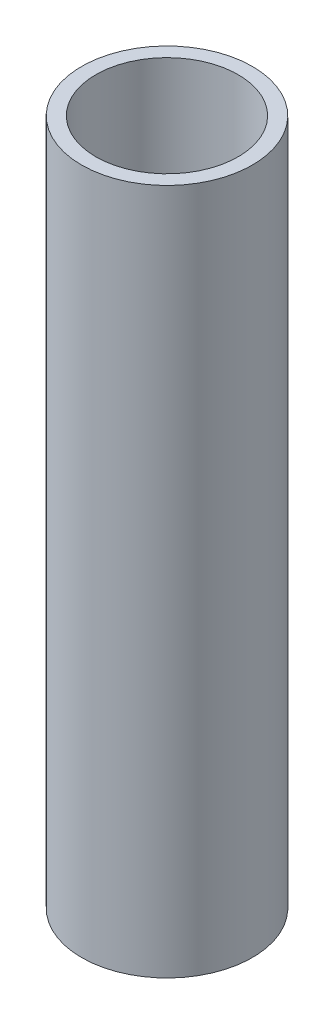
ISO-10303-21;
HEADER;
FILE_DESCRIPTION(('STEP AP214'),'2;1');
FILE_NAME('part.step','',(''),(''),'','','');
FILE_SCHEMA(('AUTOMOTIVE_DESIGN { 1 0 10303 214 1 1 1 1 }'));
ENDSEC;
DATA;
#1=APPLICATION_CONTEXT('core data for automotive mechanical design processes');
#2=APPLICATION_PROTOCOL_DEFINITION('international standard','automotive_design',2000,#1);
#3=PRODUCT_CONTEXT('',#1,'mechanical');
#4=PRODUCT('Part','Part','',(#3));
#5=PRODUCT_RELATED_PRODUCT_CATEGORY('part','',(#4));
#6=PRODUCT_DEFINITION_FORMATION('','',#4);
#7=PRODUCT_DEFINITION_CONTEXT('part definition',#1,'design');
#8=PRODUCT_DEFINITION('design','',#6,#7);
#9=PRODUCT_DEFINITION_SHAPE('','',#8);
#10=(LENGTH_UNIT() NAMED_UNIT(*) SI_UNIT(.MILLI.,.METRE.));
#11=(NAMED_UNIT(*) PLANE_ANGLE_UNIT() SI_UNIT($,.RADIAN.));
#12=(NAMED_UNIT(*) SI_UNIT($,.STERADIAN.) SOLID_ANGLE_UNIT());
#13=UNCERTAINTY_MEASURE_WITH_UNIT(LENGTH_MEASURE(1.E-05),#10,'distance_accuracy_value','');
#14=(GEOMETRIC_REPRESENTATION_CONTEXT(3) GLOBAL_UNCERTAINTY_ASSIGNED_CONTEXT((#13)) GLOBAL_UNIT_ASSIGNED_CONTEXT((#10,
#11,#12)) REPRESENTATION_CONTEXT('',''));
#15=CARTESIAN_POINT('',(0.,0.,0.));
#16=DIRECTION('',(0.,0.,1.));
#17=DIRECTION('',(1.,0.,0.));
#18=AXIS2_PLACEMENT_3D('',#15,#16,#17);
#19=CARTESIAN_POINT('',(0.,7.834,0.));
#20=DIRECTION('',(0.,1.,0.));
#21=DIRECTION('',(0.,0.,1.));
#22=AXIS2_PLACEMENT_3D('',#19,#20,#21);
#23=PLANE('',#22);
#24=CARTESIAN_POINT('',(0.,7.834,0.));
#25=DIRECTION('',(0.,1.,0.));
#26=DIRECTION('',(0.,0.,1.));
#27=AXIS2_PLACEMENT_3D('',#24,#25,#26);
#28=CIRCLE('',#27,1.95);
#29=CARTESIAN_POINT('',(0.,7.834,1.95));
#30=VERTEX_POINT('',#29);
#31=EDGE_CURVE('E10',#30,#30,#28,.T.);
#32=ORIENTED_EDGE('',*,*,#31,.T.);
#33=EDGE_LOOP('',(#32));
#34=FACE_BOUND('',#33,.T.);
#35=CARTESIAN_POINT('',(0.,7.834,0.));
#36=DIRECTION('',(0.,1.,0.));
#37=DIRECTION('',(0.,0.,1.));
#38=AXIS2_PLACEMENT_3D('',#35,#36,#37);
#39=CIRCLE('',#38,1.625);
#40=CARTESIAN_POINT('',(0.,7.834,1.625));
#41=VERTEX_POINT('',#40);
#42=EDGE_CURVE('E56',#41,#41,#39,.T.);
#43=ORIENTED_EDGE('',*,*,#42,.F.);
#44=EDGE_LOOP('',(#43));
#45=FACE_BOUND('',#44,.T.);
#46=ADVANCED_FACE('F43',(#34,#45),#23,.T.);
#47=CARTESIAN_POINT('',(0.,-7.834,0.));
#48=DIRECTION('',(0.,1.,0.));
#49=DIRECTION('',(0.,0.,1.));
#50=AXIS2_PLACEMENT_3D('',#47,#48,#49);
#51=PLANE('',#50);
#52=CARTESIAN_POINT('',(0.,-7.834,0.));
#53=DIRECTION('',(0.,1.,0.));
#54=DIRECTION('',(0.,0.,1.));
#55=AXIS2_PLACEMENT_3D('',#52,#53,#54);
#56=CIRCLE('',#55,1.95);
#57=CARTESIAN_POINT('',(0.,-7.834,1.95));
#58=VERTEX_POINT('',#57);
#59=EDGE_CURVE('E47',#58,#58,#56,.T.);
#60=ORIENTED_EDGE('',*,*,#59,.F.);
#61=EDGE_LOOP('',(#60));
#62=FACE_BOUND('',#61,.T.);
#63=CARTESIAN_POINT('',(0.,-7.834,0.));
#64=DIRECTION('',(0.,1.,0.));
#65=DIRECTION('',(0.,0.,1.));
#66=AXIS2_PLACEMENT_3D('',#63,#64,#65);
#67=CIRCLE('',#66,1.625);
#68=CARTESIAN_POINT('',(0.,-7.834,1.625));
#69=VERTEX_POINT('',#68);
#70=EDGE_CURVE('E58',#69,#69,#67,.T.);
#71=ORIENTED_EDGE('',*,*,#70,.T.);
#72=EDGE_LOOP('',(#71));
#73=FACE_BOUND('',#72,.T.);
#74=ADVANCED_FACE('F70',(#62,#73),#51,.F.);
#75=CARTESIAN_POINT('',(0.,7.834,0.));
#76=DIRECTION('',(0.,-1.,0.));
#77=DIRECTION('',(0.,0.,-1.));
#78=AXIS2_PLACEMENT_3D('',#75,#76,#77);
#79=CYLINDRICAL_SURFACE('',#78,1.95);
#80=ORIENTED_EDGE('',*,*,#31,.F.);
#81=EDGE_LOOP('',(#80));
#82=FACE_BOUND('',#81,.T.);
#83=ORIENTED_EDGE('',*,*,#59,.T.);
#84=EDGE_LOOP('',(#83));
#85=FACE_BOUND('',#84,.T.);
#86=ADVANCED_FACE('F45',(#82,#85),#79,.T.);
#87=CARTESIAN_POINT('',(0.,7.834,0.));
#88=DIRECTION('',(0.,-1.,0.));
#89=DIRECTION('',(0.,0.,-1.));
#90=AXIS2_PLACEMENT_3D('',#87,#88,#89);
#91=CYLINDRICAL_SURFACE('',#90,1.625);
#92=ORIENTED_EDGE('',*,*,#42,.T.);
#93=EDGE_LOOP('',(#92));
#94=FACE_BOUND('',#93,.T.);
#95=ORIENTED_EDGE('',*,*,#70,.F.);
#96=EDGE_LOOP('',(#95));
#97=FACE_BOUND('',#96,.T.);
#98=ADVANCED_FACE('F66',(#94,#97),#91,.F.);
#99=CLOSED_SHELL('',(#46,#74,#86,#98));
#100=MANIFOLD_SOLID_BREP('B2',#99);
#101=ADVANCED_BREP_SHAPE_REPRESENTATION('',(#18,#100),#14);
#102=SHAPE_DEFINITION_REPRESENTATION(#9,#101);
ENDSEC;
END-ISO-10303-21;
